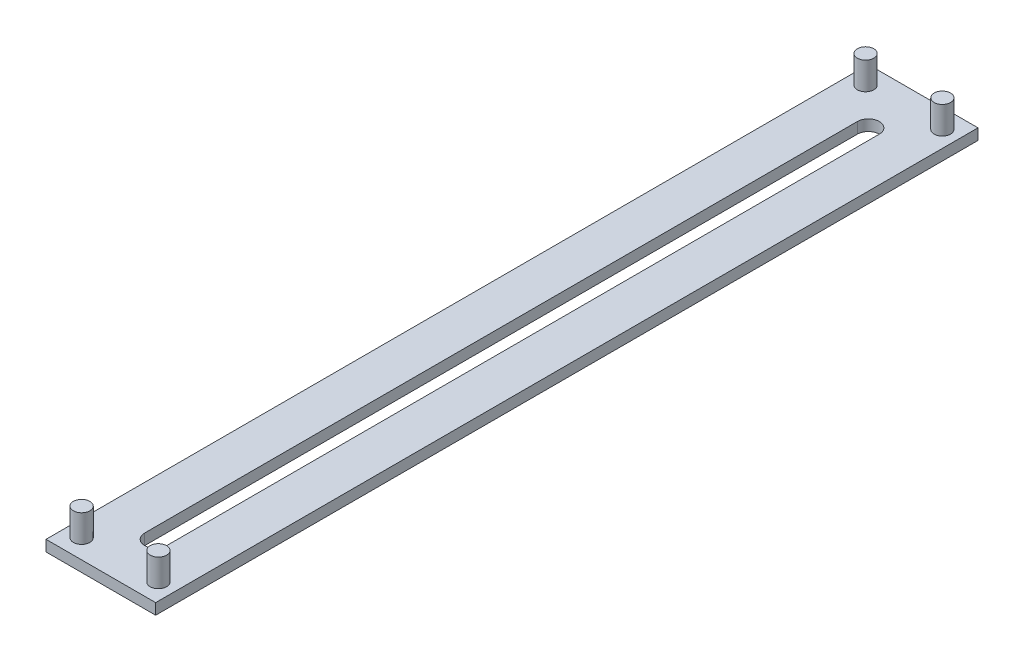
ISO-10303-21;
HEADER;
FILE_DESCRIPTION(('STEP AP214'),'2;1');
FILE_NAME('part.step','',(''),(''),'','','');
FILE_SCHEMA(('AUTOMOTIVE_DESIGN { 1 0 10303 214 1 1 1 1 }'));
ENDSEC;
DATA;
#1=APPLICATION_CONTEXT('core data for automotive mechanical design processes');
#2=APPLICATION_PROTOCOL_DEFINITION('international standard','automotive_design',2000,#1);
#3=PRODUCT_CONTEXT('',#1,'mechanical');
#4=PRODUCT('Part','Part','',(#3));
#5=PRODUCT_RELATED_PRODUCT_CATEGORY('part','',(#4));
#6=PRODUCT_DEFINITION_FORMATION('','',#4);
#7=PRODUCT_DEFINITION_CONTEXT('part definition',#1,'design');
#8=PRODUCT_DEFINITION('design','',#6,#7);
#9=PRODUCT_DEFINITION_SHAPE('','',#8);
#10=(LENGTH_UNIT() NAMED_UNIT(*) SI_UNIT(.MILLI.,.METRE.));
#11=(NAMED_UNIT(*) PLANE_ANGLE_UNIT() SI_UNIT($,.RADIAN.));
#12=(NAMED_UNIT(*) SI_UNIT($,.STERADIAN.) SOLID_ANGLE_UNIT());
#13=UNCERTAINTY_MEASURE_WITH_UNIT(LENGTH_MEASURE(1.E-05),#10,'distance_accuracy_value','');
#14=(GEOMETRIC_REPRESENTATION_CONTEXT(3) GLOBAL_UNCERTAINTY_ASSIGNED_CONTEXT((#13)) GLOBAL_UNIT_ASSIGNED_CONTEXT((#10,
#11,#12)) REPRESENTATION_CONTEXT('',''));
#15=CARTESIAN_POINT('',(0.,0.,0.));
#16=DIRECTION('',(0.,0.,1.));
#17=DIRECTION('',(1.,0.,0.));
#18=AXIS2_PLACEMENT_3D('',#15,#16,#17);
#19=CARTESIAN_POINT('',(0.,2.,0.));
#20=DIRECTION('',(0.,1.,0.));
#21=DIRECTION('',(0.,0.,1.));
#22=AXIS2_PLACEMENT_3D('',#19,#20,#21);
#23=PLANE('',#22);
#24=CARTESIAN_POINT('',(0.,2.,65.));
#25=DIRECTION('',(0.,1.,0.));
#26=DIRECTION('',(0.,0.,1.));
#27=AXIS2_PLACEMENT_3D('',#24,#25,#26);
#28=CIRCLE('',#27,2.00000000000003);
#29=CARTESIAN_POINT('',(-2.00000000000003,2.,65.));
#30=VERTEX_POINT('',#29);
#31=CARTESIAN_POINT('',(2.00000000000003,2.,65.));
#32=VERTEX_POINT('',#31);
#33=EDGE_CURVE('E34',#30,#32,#28,.T.);
#34=ORIENTED_EDGE('',*,*,#33,.F.);
#35=DIRECTION('',(0.,0.,1.));
#36=VECTOR('',#35,1.);
#37=CARTESIAN_POINT('',(-2.00000000000003,2.,65.));
#38=LINE('',#37,#36);
#39=CARTESIAN_POINT('',(-2.00000000000005,2.,-65.));
#40=VERTEX_POINT('',#39);
#41=EDGE_CURVE('E102',#40,#30,#38,.T.);
#42=ORIENTED_EDGE('',*,*,#41,.F.);
#43=CARTESIAN_POINT('',(0.,2.,-65.));
#44=DIRECTION('',(0.,1.,0.));
#45=DIRECTION('',(0.,0.,1.));
#46=AXIS2_PLACEMENT_3D('',#43,#44,#45);
#47=CIRCLE('',#46,2.00000000000003);
#48=CARTESIAN_POINT('',(2.,2.,-65.));
#49=VERTEX_POINT('',#48);
#50=EDGE_CURVE('E105',#49,#40,#47,.T.);
#51=ORIENTED_EDGE('',*,*,#50,.F.);
#52=DIRECTION('',(0.,0.,-1.));
#53=VECTOR('',#52,1.);
#54=CARTESIAN_POINT('',(2.00000000000003,2.,65.));
#55=LINE('',#54,#53);
#56=EDGE_CURVE('E111',#32,#49,#55,.T.);
#57=ORIENTED_EDGE('',*,*,#56,.F.);
#58=EDGE_LOOP('',(#34,#42,#51,#57));
#59=FACE_BOUND('',#58,.T.);
#60=CARTESIAN_POINT('',(-7.,2.,71.5));
#61=DIRECTION('',(0.,1.,0.));
#62=DIRECTION('',(0.,0.,1.));
#63=AXIS2_PLACEMENT_3D('',#60,#61,#62);
#64=CIRCLE('',#63,1.5);
#65=CARTESIAN_POINT('',(-7.,2.,73.));
#66=VERTEX_POINT('',#65);
#67=EDGE_CURVE('E124',#66,#66,#64,.T.);
#68=ORIENTED_EDGE('',*,*,#67,.F.);
#69=EDGE_LOOP('',(#68));
#70=FACE_BOUND('',#69,.T.);
#71=CARTESIAN_POINT('',(-7.,2.,-71.5));
#72=DIRECTION('',(0.,1.,0.));
#73=DIRECTION('',(0.,0.,1.));
#74=AXIS2_PLACEMENT_3D('',#71,#72,#73);
#75=CIRCLE('',#74,1.5);
#76=CARTESIAN_POINT('',(-7.,2.,-70.));
#77=VERTEX_POINT('',#76);
#78=EDGE_CURVE('E136',#77,#77,#75,.T.);
#79=ORIENTED_EDGE('',*,*,#78,.F.);
#80=EDGE_LOOP('',(#79));
#81=FACE_BOUND('',#80,.T.);
#82=DIRECTION('',(0.,0.,1.));
#83=VECTOR('',#82,1.);
#84=CARTESIAN_POINT('',(-10.,2.,75.));
#85=LINE('',#84,#83);
#86=CARTESIAN_POINT('',(-10.,2.,-75.));
#87=VERTEX_POINT('',#86);
#88=CARTESIAN_POINT('',(-10.,2.,75.));
#89=VERTEX_POINT('',#88);
#90=EDGE_CURVE('E145',#87,#89,#85,.T.);
#91=ORIENTED_EDGE('',*,*,#90,.T.);
#92=DIRECTION('',(1.,0.,0.));
#93=VECTOR('',#92,1.);
#94=CARTESIAN_POINT('',(10.,2.,75.));
#95=LINE('',#94,#93);
#96=CARTESIAN_POINT('',(10.,2.,75.));
#97=VERTEX_POINT('',#96);
#98=EDGE_CURVE('E148',#89,#97,#95,.T.);
#99=ORIENTED_EDGE('',*,*,#98,.T.);
#100=DIRECTION('',(0.,0.,-1.));
#101=VECTOR('',#100,1.);
#102=CARTESIAN_POINT('',(10.,2.,75.));
#103=LINE('',#102,#101);
#104=CARTESIAN_POINT('',(10.,2.,-75.));
#105=VERTEX_POINT('',#104);
#106=EDGE_CURVE('E151',#97,#105,#103,.T.);
#107=ORIENTED_EDGE('',*,*,#106,.T.);
#108=DIRECTION('',(-1.,0.,0.));
#109=VECTOR('',#108,1.);
#110=CARTESIAN_POINT('',(10.,2.,-75.));
#111=LINE('',#110,#109);
#112=EDGE_CURVE('E153',#105,#87,#111,.T.);
#113=ORIENTED_EDGE('',*,*,#112,.T.);
#114=EDGE_LOOP('',(#91,#99,#107,#113));
#115=FACE_BOUND('',#114,.T.);
#116=CARTESIAN_POINT('',(7.,2.,-71.5));
#117=DIRECTION('',(0.,1.,0.));
#118=DIRECTION('',(0.,0.,1.));
#119=AXIS2_PLACEMENT_3D('',#116,#117,#118);
#120=CIRCLE('',#119,1.5);
#121=CARTESIAN_POINT('',(7.,2.,-70.));
#122=VERTEX_POINT('',#121);
#123=EDGE_CURVE('E130',#122,#122,#120,.T.);
#124=ORIENTED_EDGE('',*,*,#123,.F.);
#125=EDGE_LOOP('',(#124));
#126=FACE_BOUND('',#125,.T.);
#127=CARTESIAN_POINT('',(7.,2.,71.5));
#128=DIRECTION('',(0.,1.,0.));
#129=DIRECTION('',(0.,0.,1.));
#130=AXIS2_PLACEMENT_3D('',#127,#128,#129);
#131=CIRCLE('',#130,1.5);
#132=CARTESIAN_POINT('',(7.,2.,73.));
#133=VERTEX_POINT('',#132);
#134=EDGE_CURVE('E117',#133,#133,#131,.T.);
#135=ORIENTED_EDGE('',*,*,#134,.F.);
#136=EDGE_LOOP('',(#135));
#137=FACE_BOUND('',#136,.T.);
#138=ADVANCED_FACE('F19',(#59,#70,#81,#115,#126,#137),#23,.T.);
#139=CARTESIAN_POINT('',(-10.,2.,75.));
#140=DIRECTION('',(1.,0.,0.));
#141=DIRECTION('',(0.,0.,-1.));
#142=AXIS2_PLACEMENT_3D('',#139,#140,#141);
#143=PLANE('',#142);
#144=DIRECTION('',(0.,0.,1.));
#145=VECTOR('',#144,1.);
#146=CARTESIAN_POINT('',(-10.,0.,75.));
#147=LINE('',#146,#145);
#148=CARTESIAN_POINT('',(-10.,0.,-75.));
#149=VERTEX_POINT('',#148);
#150=CARTESIAN_POINT('',(-10.,0.,75.));
#151=VERTEX_POINT('',#150);
#152=EDGE_CURVE('E142',#149,#151,#147,.T.);
#153=ORIENTED_EDGE('',*,*,#152,.T.);
#154=DIRECTION('',(0.,-1.,0.));
#155=VECTOR('',#154,1.);
#156=CARTESIAN_POINT('',(-10.,2.,75.));
#157=LINE('',#156,#155);
#158=EDGE_CURVE('E11',#89,#151,#157,.T.);
#159=ORIENTED_EDGE('',*,*,#158,.F.);
#160=ORIENTED_EDGE('',*,*,#90,.F.);
#161=DIRECTION('',(0.,-1.,0.));
#162=VECTOR('',#161,1.);
#163=CARTESIAN_POINT('',(-10.,2.,-75.));
#164=LINE('',#163,#162);
#165=EDGE_CURVE('E155',#87,#149,#164,.T.);
#166=ORIENTED_EDGE('',*,*,#165,.T.);
#167=EDGE_LOOP('',(#153,#159,#160,#166));
#168=FACE_BOUND('',#167,.T.);
#169=ADVANCED_FACE('F21',(#168),#143,.F.);
#170=CARTESIAN_POINT('',(10.,2.,75.));
#171=DIRECTION('',(0.,0.,-1.));
#172=DIRECTION('',(-1.,0.,0.));
#173=AXIS2_PLACEMENT_3D('',#170,#171,#172);
#174=PLANE('',#173);
#175=DIRECTION('',(1.,0.,0.));
#176=VECTOR('',#175,1.);
#177=CARTESIAN_POINT('',(10.,0.,75.));
#178=LINE('',#177,#176);
#179=CARTESIAN_POINT('',(10.,0.,75.));
#180=VERTEX_POINT('',#179);
#181=EDGE_CURVE('E158',#151,#180,#178,.T.);
#182=ORIENTED_EDGE('',*,*,#181,.T.);
#183=DIRECTION('',(0.,-1.,0.));
#184=VECTOR('',#183,1.);
#185=CARTESIAN_POINT('',(10.,2.,75.));
#186=LINE('',#185,#184);
#187=EDGE_CURVE('E27',#97,#180,#186,.T.);
#188=ORIENTED_EDGE('',*,*,#187,.F.);
#189=ORIENTED_EDGE('',*,*,#98,.F.);
#190=ORIENTED_EDGE('',*,*,#158,.T.);
#191=EDGE_LOOP('',(#182,#188,#189,#190));
#192=FACE_BOUND('',#191,.T.);
#193=ADVANCED_FACE('F186',(#192),#174,.F.);
#194=CARTESIAN_POINT('',(10.,2.,75.));
#195=DIRECTION('',(-1.,0.,0.));
#196=DIRECTION('',(0.,0.,1.));
#197=AXIS2_PLACEMENT_3D('',#194,#195,#196);
#198=PLANE('',#197);
#199=DIRECTION('',(0.,0.,-1.));
#200=VECTOR('',#199,1.);
#201=CARTESIAN_POINT('',(10.,0.,75.));
#202=LINE('',#201,#200);
#203=CARTESIAN_POINT('',(10.,0.,-75.));
#204=VERTEX_POINT('',#203);
#205=EDGE_CURVE('E160',#180,#204,#202,.T.);
#206=ORIENTED_EDGE('',*,*,#205,.T.);
#207=DIRECTION('',(0.,-1.,0.));
#208=VECTOR('',#207,1.);
#209=CARTESIAN_POINT('',(10.,2.,-75.));
#210=LINE('',#209,#208);
#211=EDGE_CURVE('E165',#105,#204,#210,.T.);
#212=ORIENTED_EDGE('',*,*,#211,.F.);
#213=ORIENTED_EDGE('',*,*,#106,.F.);
#214=ORIENTED_EDGE('',*,*,#187,.T.);
#215=EDGE_LOOP('',(#206,#212,#213,#214));
#216=FACE_BOUND('',#215,.T.);
#217=ADVANCED_FACE('F172',(#216),#198,.F.);
#218=CARTESIAN_POINT('',(10.,2.,-75.));
#219=DIRECTION('',(0.,0.,1.));
#220=DIRECTION('',(1.,0.,0.));
#221=AXIS2_PLACEMENT_3D('',#218,#219,#220);
#222=PLANE('',#221);
#223=DIRECTION('',(-1.,0.,0.));
#224=VECTOR('',#223,1.);
#225=CARTESIAN_POINT('',(10.,0.,-75.));
#226=LINE('',#225,#224);
#227=EDGE_CURVE('E149',#204,#149,#226,.T.);
#228=ORIENTED_EDGE('',*,*,#227,.T.);
#229=ORIENTED_EDGE('',*,*,#165,.F.);
#230=ORIENTED_EDGE('',*,*,#112,.F.);
#231=ORIENTED_EDGE('',*,*,#211,.T.);
#232=EDGE_LOOP('',(#228,#229,#230,#231));
#233=FACE_BOUND('',#232,.T.);
#234=ADVANCED_FACE('F179',(#233),#222,.F.);
#235=CARTESIAN_POINT('',(0.,0.,0.));
#236=DIRECTION('',(0.,1.,0.));
#237=DIRECTION('',(0.,0.,1.));
#238=AXIS2_PLACEMENT_3D('',#235,#236,#237);
#239=PLANE('',#238);
#240=DIRECTION('',(0.,0.,1.));
#241=VECTOR('',#240,1.);
#242=CARTESIAN_POINT('',(-2.00000000000003,0.,65.));
#243=LINE('',#242,#241);
#244=CARTESIAN_POINT('',(-2.00000000000005,0.,-65.));
#245=VERTEX_POINT('',#244);
#246=CARTESIAN_POINT('',(-2.00000000000003,0.,65.));
#247=VERTEX_POINT('',#246);
#248=EDGE_CURVE('E92',#245,#247,#243,.T.);
#249=ORIENTED_EDGE('',*,*,#248,.T.);
#250=CARTESIAN_POINT('',(0.,0.,65.));
#251=DIRECTION('',(0.,1.,0.));
#252=DIRECTION('',(0.,0.,1.));
#253=AXIS2_PLACEMENT_3D('',#250,#251,#252);
#254=CIRCLE('',#253,2.00000000000003);
#255=CARTESIAN_POINT('',(2.00000000000003,0.,65.));
#256=VERTEX_POINT('',#255);
#257=EDGE_CURVE('E86',#247,#256,#254,.T.);
#258=ORIENTED_EDGE('',*,*,#257,.T.);
#259=DIRECTION('',(0.,0.,-1.));
#260=VECTOR('',#259,1.);
#261=CARTESIAN_POINT('',(2.00000000000003,0.,65.));
#262=LINE('',#261,#260);
#263=CARTESIAN_POINT('',(2.,0.,-65.));
#264=VERTEX_POINT('',#263);
#265=EDGE_CURVE('E95',#256,#264,#262,.T.);
#266=ORIENTED_EDGE('',*,*,#265,.T.);
#267=CARTESIAN_POINT('',(0.,0.,-65.));
#268=DIRECTION('',(0.,1.,0.));
#269=DIRECTION('',(0.,0.,1.));
#270=AXIS2_PLACEMENT_3D('',#267,#268,#269);
#271=CIRCLE('',#270,2.00000000000003);
#272=EDGE_CURVE('E42',#264,#245,#271,.T.);
#273=ORIENTED_EDGE('',*,*,#272,.T.);
#274=EDGE_LOOP('',(#249,#258,#266,#273));
#275=FACE_BOUND('',#274,.T.);
#276=ORIENTED_EDGE('',*,*,#152,.F.);
#277=ORIENTED_EDGE('',*,*,#227,.F.);
#278=ORIENTED_EDGE('',*,*,#205,.F.);
#279=ORIENTED_EDGE('',*,*,#181,.F.);
#280=EDGE_LOOP('',(#276,#277,#278,#279));
#281=FACE_BOUND('',#280,.T.);
#282=ADVANCED_FACE('F99',(#275,#281),#239,.F.);
#283=CARTESIAN_POINT('',(-7.,7.,-71.5));
#284=DIRECTION('',(0.,-1.,0.));
#285=DIRECTION('',(0.,0.,-1.));
#286=AXIS2_PLACEMENT_3D('',#283,#284,#285);
#287=CYLINDRICAL_SURFACE('',#286,1.5);
#288=CARTESIAN_POINT('',(-7.,7.,-71.5));
#289=DIRECTION('',(0.,1.,0.));
#290=DIRECTION('',(0.,0.,1.));
#291=AXIS2_PLACEMENT_3D('',#288,#289,#290);
#292=CIRCLE('',#291,1.5);
#293=CARTESIAN_POINT('',(-7.,7.,-70.));
#294=VERTEX_POINT('',#293);
#295=EDGE_CURVE('E139',#294,#294,#292,.T.);
#296=ORIENTED_EDGE('',*,*,#295,.F.);
#297=EDGE_LOOP('',(#296));
#298=FACE_BOUND('',#297,.T.);
#299=ORIENTED_EDGE('',*,*,#78,.T.);
#300=EDGE_LOOP('',(#299));
#301=FACE_BOUND('',#300,.T.);
#302=ADVANCED_FACE('F204',(#298,#301),#287,.T.);
#303=CARTESIAN_POINT('',(-7.,7.,-71.5));
#304=DIRECTION('',(0.,1.,0.));
#305=DIRECTION('',(0.,0.,1.));
#306=AXIS2_PLACEMENT_3D('',#303,#304,#305);
#307=PLANE('',#306);
#308=ORIENTED_EDGE('',*,*,#295,.T.);
#309=EDGE_LOOP('',(#308));
#310=FACE_BOUND('',#309,.T.);
#311=ADVANCED_FACE('F230',(#310),#307,.T.);
#312=CARTESIAN_POINT('',(7.,7.,-71.5));
#313=DIRECTION('',(0.,-1.,0.));
#314=DIRECTION('',(0.,0.,-1.));
#315=AXIS2_PLACEMENT_3D('',#312,#313,#314);
#316=CYLINDRICAL_SURFACE('',#315,1.5);
#317=CARTESIAN_POINT('',(7.,7.,-71.5));
#318=DIRECTION('',(0.,1.,0.));
#319=DIRECTION('',(0.,0.,1.));
#320=AXIS2_PLACEMENT_3D('',#317,#318,#319);
#321=CIRCLE('',#320,1.5);
#322=CARTESIAN_POINT('',(7.,7.,-70.));
#323=VERTEX_POINT('',#322);
#324=EDGE_CURVE('E133',#323,#323,#321,.T.);
#325=ORIENTED_EDGE('',*,*,#324,.F.);
#326=EDGE_LOOP('',(#325));
#327=FACE_BOUND('',#326,.T.);
#328=ORIENTED_EDGE('',*,*,#123,.T.);
#329=EDGE_LOOP('',(#328));
#330=FACE_BOUND('',#329,.T.);
#331=ADVANCED_FACE('F238',(#327,#330),#316,.T.);
#332=CARTESIAN_POINT('',(7.,7.,-71.5));
#333=DIRECTION('',(0.,1.,0.));
#334=DIRECTION('',(0.,0.,1.));
#335=AXIS2_PLACEMENT_3D('',#332,#333,#334);
#336=PLANE('',#335);
#337=ORIENTED_EDGE('',*,*,#324,.T.);
#338=EDGE_LOOP('',(#337));
#339=FACE_BOUND('',#338,.T.);
#340=ADVANCED_FACE('F246',(#339),#336,.T.);
#341=CARTESIAN_POINT('',(-7.,7.,71.5));
#342=DIRECTION('',(0.,-1.,0.));
#343=DIRECTION('',(0.,0.,-1.));
#344=AXIS2_PLACEMENT_3D('',#341,#342,#343);
#345=CYLINDRICAL_SURFACE('',#344,1.5);
#346=CARTESIAN_POINT('',(-7.,7.,71.5));
#347=DIRECTION('',(0.,1.,0.));
#348=DIRECTION('',(0.,0.,1.));
#349=AXIS2_PLACEMENT_3D('',#346,#347,#348);
#350=CIRCLE('',#349,1.5);
#351=CARTESIAN_POINT('',(-7.,7.,73.));
#352=VERTEX_POINT('',#351);
#353=EDGE_CURVE('E127',#352,#352,#350,.T.);
#354=ORIENTED_EDGE('',*,*,#353,.F.);
#355=EDGE_LOOP('',(#354));
#356=FACE_BOUND('',#355,.T.);
#357=ORIENTED_EDGE('',*,*,#67,.T.);
#358=EDGE_LOOP('',(#357));
#359=FACE_BOUND('',#358,.T.);
#360=ADVANCED_FACE('F255',(#356,#359),#345,.T.);
#361=CARTESIAN_POINT('',(-7.,7.,71.5));
#362=DIRECTION('',(0.,1.,0.));
#363=DIRECTION('',(0.,0.,1.));
#364=AXIS2_PLACEMENT_3D('',#361,#362,#363);
#365=PLANE('',#364);
#366=ORIENTED_EDGE('',*,*,#353,.T.);
#367=EDGE_LOOP('',(#366));
#368=FACE_BOUND('',#367,.T.);
#369=ADVANCED_FACE('F264',(#368),#365,.T.);
#370=CARTESIAN_POINT('',(7.,7.,71.5));
#371=DIRECTION('',(0.,-1.,0.));
#372=DIRECTION('',(0.,0.,-1.));
#373=AXIS2_PLACEMENT_3D('',#370,#371,#372);
#374=CYLINDRICAL_SURFACE('',#373,1.5);
#375=CARTESIAN_POINT('',(7.,7.,71.5));
#376=DIRECTION('',(0.,1.,0.));
#377=DIRECTION('',(0.,0.,1.));
#378=AXIS2_PLACEMENT_3D('',#375,#376,#377);
#379=CIRCLE('',#378,1.5);
#380=CARTESIAN_POINT('',(7.,7.,73.));
#381=VERTEX_POINT('',#380);
#382=EDGE_CURVE('E121',#381,#381,#379,.T.);
#383=ORIENTED_EDGE('',*,*,#382,.F.);
#384=EDGE_LOOP('',(#383));
#385=FACE_BOUND('',#384,.T.);
#386=ORIENTED_EDGE('',*,*,#134,.T.);
#387=EDGE_LOOP('',(#386));
#388=FACE_BOUND('',#387,.T.);
#389=ADVANCED_FACE('F273',(#385,#388),#374,.T.);
#390=CARTESIAN_POINT('',(7.,7.,71.5));
#391=DIRECTION('',(0.,1.,0.));
#392=DIRECTION('',(0.,0.,1.));
#393=AXIS2_PLACEMENT_3D('',#390,#391,#392);
#394=PLANE('',#393);
#395=ORIENTED_EDGE('',*,*,#382,.T.);
#396=EDGE_LOOP('',(#395));
#397=FACE_BOUND('',#396,.T.);
#398=ADVANCED_FACE('F282',(#397),#394,.T.);
#399=CARTESIAN_POINT('',(0.,0.,65.));
#400=DIRECTION('',(0.,1.,0.));
#401=DIRECTION('',(0.,0.,1.));
#402=AXIS2_PLACEMENT_3D('',#399,#400,#401);
#403=CYLINDRICAL_SURFACE('',#402,2.00000000000003);
#404=ORIENTED_EDGE('',*,*,#33,.T.);
#405=DIRECTION('',(0.,1.,0.));
#406=VECTOR('',#405,1.);
#407=CARTESIAN_POINT('',(2.00000000000003,0.,65.));
#408=LINE('',#407,#406);
#409=EDGE_CURVE('E82',#256,#32,#408,.T.);
#410=ORIENTED_EDGE('',*,*,#409,.F.);
#411=ORIENTED_EDGE('',*,*,#257,.F.);
#412=DIRECTION('',(0.,1.,0.));
#413=VECTOR('',#412,1.);
#414=CARTESIAN_POINT('',(-2.00000000000003,0.,65.));
#415=LINE('',#414,#413);
#416=EDGE_CURVE('E115',#247,#30,#415,.T.);
#417=ORIENTED_EDGE('',*,*,#416,.T.);
#418=EDGE_LOOP('',(#404,#410,#411,#417));
#419=FACE_BOUND('',#418,.T.);
#420=ADVANCED_FACE('F84',(#419),#403,.F.);
#421=CARTESIAN_POINT('',(-2.00000000000003,0.,65.));
#422=DIRECTION('',(-1.,0.,0.));
#423=DIRECTION('',(0.,0.,1.));
#424=AXIS2_PLACEMENT_3D('',#421,#422,#423);
#425=PLANE('',#424);
#426=ORIENTED_EDGE('',*,*,#41,.T.);
#427=ORIENTED_EDGE('',*,*,#416,.F.);
#428=ORIENTED_EDGE('',*,*,#248,.F.);
#429=DIRECTION('',(0.,1.,0.));
#430=VECTOR('',#429,1.);
#431=CARTESIAN_POINT('',(-2.00000000000005,0.,-65.));
#432=LINE('',#431,#430);
#433=EDGE_CURVE('E118',#245,#40,#432,.T.);
#434=ORIENTED_EDGE('',*,*,#433,.T.);
#435=EDGE_LOOP('',(#426,#427,#428,#434));
#436=FACE_BOUND('',#435,.T.);
#437=ADVANCED_FACE('F299',(#436),#425,.F.);
#438=CARTESIAN_POINT('',(0.,0.,-65.));
#439=DIRECTION('',(0.,1.,0.));
#440=DIRECTION('',(0.,0.,1.));
#441=AXIS2_PLACEMENT_3D('',#438,#439,#440);
#442=CYLINDRICAL_SURFACE('',#441,2.00000000000003);
#443=ORIENTED_EDGE('',*,*,#50,.T.);
#444=ORIENTED_EDGE('',*,*,#433,.F.);
#445=ORIENTED_EDGE('',*,*,#272,.F.);
#446=DIRECTION('',(0.,1.,0.));
#447=VECTOR('',#446,1.);
#448=CARTESIAN_POINT('',(2.,0.,-65.));
#449=LINE('',#448,#447);
#450=EDGE_CURVE('E91',#264,#49,#449,.T.);
#451=ORIENTED_EDGE('',*,*,#450,.T.);
#452=EDGE_LOOP('',(#443,#444,#445,#451));
#453=FACE_BOUND('',#452,.T.);
#454=ADVANCED_FACE('F307',(#453),#442,.F.);
#455=CARTESIAN_POINT('',(2.00000000000003,0.,65.));
#456=DIRECTION('',(1.,0.,0.));
#457=DIRECTION('',(0.,0.,-1.));
#458=AXIS2_PLACEMENT_3D('',#455,#456,#457);
#459=PLANE('',#458);
#460=ORIENTED_EDGE('',*,*,#56,.T.);
#461=ORIENTED_EDGE('',*,*,#450,.F.);
#462=ORIENTED_EDGE('',*,*,#265,.F.);
#463=ORIENTED_EDGE('',*,*,#409,.T.);
#464=EDGE_LOOP('',(#460,#461,#462,#463));
#465=FACE_BOUND('',#464,.T.);
#466=ADVANCED_FACE('F96',(#465),#459,.F.);
#467=CLOSED_SHELL('',(#138,#169,#193,#217,#234,#282,#302,#311,#331,#340,#360,#369,#389,#398,
#420,#437,#454,#466));
#468=MANIFOLD_SOLID_BREP('B1',#467);
#469=ADVANCED_BREP_SHAPE_REPRESENTATION('',(#18,#468),#14);
#470=SHAPE_DEFINITION_REPRESENTATION(#9,#469);
ENDSEC;
END-ISO-10303-21;
